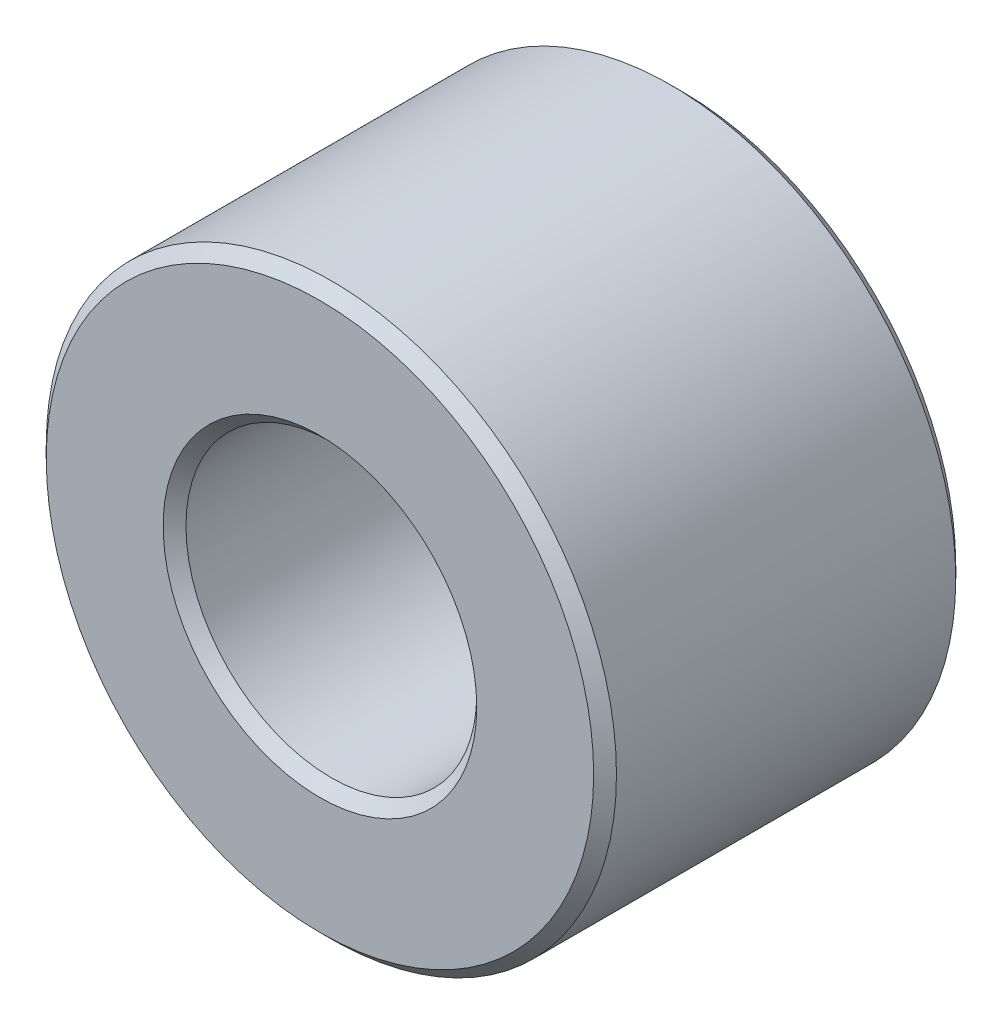
ISO-10303-21;
HEADER;
FILE_DESCRIPTION(('STEP AP214'),'2;1');
FILE_NAME('part.step','',(''),(''),'','','');
FILE_SCHEMA(('AUTOMOTIVE_DESIGN { 1 0 10303 214 1 1 1 1 }'));
ENDSEC;
DATA;
#1=APPLICATION_CONTEXT('core data for automotive mechanical design processes');
#2=APPLICATION_PROTOCOL_DEFINITION('international standard','automotive_design',2000,#1);
#3=PRODUCT_CONTEXT('',#1,'mechanical');
#4=PRODUCT('Part','Part','',(#3));
#5=PRODUCT_RELATED_PRODUCT_CATEGORY('part','',(#4));
#6=PRODUCT_DEFINITION_FORMATION('','',#4);
#7=PRODUCT_DEFINITION_CONTEXT('part definition',#1,'design');
#8=PRODUCT_DEFINITION('design','',#6,#7);
#9=PRODUCT_DEFINITION_SHAPE('','',#8);
#10=(LENGTH_UNIT() NAMED_UNIT(*) SI_UNIT(.MILLI.,.METRE.));
#11=(NAMED_UNIT(*) PLANE_ANGLE_UNIT() SI_UNIT($,.RADIAN.));
#12=(NAMED_UNIT(*) SI_UNIT($,.STERADIAN.) SOLID_ANGLE_UNIT());
#13=UNCERTAINTY_MEASURE_WITH_UNIT(LENGTH_MEASURE(1.E-05),#10,'distance_accuracy_value','');
#14=(GEOMETRIC_REPRESENTATION_CONTEXT(3) GLOBAL_UNCERTAINTY_ASSIGNED_CONTEXT((#13)) GLOBAL_UNIT_ASSIGNED_CONTEXT((#10,
#11,#12)) REPRESENTATION_CONTEXT('',''));
#15=CARTESIAN_POINT('',(0.,0.,0.));
#16=DIRECTION('',(0.,0.,1.));
#17=DIRECTION('',(1.,0.,0.));
#18=AXIS2_PLACEMENT_3D('',#15,#16,#17);
#19=CARTESIAN_POINT('',(0.,0.,6.35000000000002));
#20=DIRECTION('',(0.,0.,1.));
#21=DIRECTION('',(1.,0.,0.));
#22=AXIS2_PLACEMENT_3D('',#19,#20,#21);
#23=PLANE('',#22);
#24=CARTESIAN_POINT('',(0.,0.,6.35000000000002));
#25=DIRECTION('',(0.,0.,1.));
#26=DIRECTION('',(1.,0.,0.));
#27=AXIS2_PLACEMENT_3D('',#24,#25,#26);
#28=CIRCLE('',#27,2.75);
#29=CARTESIAN_POINT('',(2.75,0.,6.35000000000002));
#30=VERTEX_POINT('',#29);
#31=EDGE_CURVE('E12',#30,#30,#28,.F.);
#32=ORIENTED_EDGE('',*,*,#31,.T.);
#33=EDGE_LOOP('',(#32));
#34=FACE_BOUND('',#33,.T.);
#35=CARTESIAN_POINT('',(0.,0.,6.35000000000002));
#36=DIRECTION('',(0.,0.,1.));
#37=DIRECTION('',(1.,0.,0.));
#38=AXIS2_PLACEMENT_3D('',#35,#36,#37);
#39=CIRCLE('',#38,4.8);
#40=CARTESIAN_POINT('',(4.8,0.,6.35000000000002));
#41=VERTEX_POINT('',#40);
#42=EDGE_CURVE('E51',#41,#41,#39,.T.);
#43=ORIENTED_EDGE('',*,*,#42,.T.);
#44=EDGE_LOOP('',(#43));
#45=FACE_BOUND('',#44,.T.);
#46=ADVANCED_FACE('F44',(#34,#45),#23,.T.);
#47=CARTESIAN_POINT('',(0.,0.,0.));
#48=DIRECTION('',(0.,0.,1.));
#49=DIRECTION('',(1.,0.,0.));
#50=AXIS2_PLACEMENT_3D('',#47,#48,#49);
#51=PLANE('',#50);
#52=CARTESIAN_POINT('',(0.,0.,0.));
#53=DIRECTION('',(0.,0.,1.));
#54=DIRECTION('',(1.,0.,0.));
#55=AXIS2_PLACEMENT_3D('',#52,#53,#54);
#56=CIRCLE('',#55,4.8);
#57=CARTESIAN_POINT('',(4.8,0.,0.));
#58=VERTEX_POINT('',#57);
#59=EDGE_CURVE('E64',#58,#58,#56,.F.);
#60=ORIENTED_EDGE('',*,*,#59,.T.);
#61=EDGE_LOOP('',(#60));
#62=FACE_BOUND('',#61,.T.);
#63=CARTESIAN_POINT('',(0.,0.,0.));
#64=DIRECTION('',(0.,0.,1.));
#65=DIRECTION('',(1.,0.,0.));
#66=AXIS2_PLACEMENT_3D('',#63,#64,#65);
#67=CIRCLE('',#66,2.75);
#68=CARTESIAN_POINT('',(2.75,0.,0.));
#69=VERTEX_POINT('',#68);
#70=EDGE_CURVE('E67',#69,#69,#67,.T.);
#71=ORIENTED_EDGE('',*,*,#70,.T.);
#72=EDGE_LOOP('',(#71));
#73=FACE_BOUND('',#72,.T.);
#74=ADVANCED_FACE('F88',(#62,#73),#51,.F.);
#75=CARTESIAN_POINT('',(0.,0.,6.35000000000002));
#76=DIRECTION('',(0.,0.,-1.));
#77=DIRECTION('',(-1.,0.,0.));
#78=AXIS2_PLACEMENT_3D('',#75,#76,#77);
#79=CYLINDRICAL_SURFACE('',#78,5.);
#80=CARTESIAN_POINT('',(0.,0.,0.199999999999978));
#81=DIRECTION('',(0.,0.,1.));
#82=DIRECTION('',(1.,0.,0.));
#83=AXIS2_PLACEMENT_3D('',#80,#81,#82);
#84=CIRCLE('',#83,5.);
#85=CARTESIAN_POINT('',(5.,0.,0.199999999999979));
#86=VERTEX_POINT('',#85);
#87=EDGE_CURVE('E70',#86,#86,#84,.T.);
#88=ORIENTED_EDGE('',*,*,#87,.T.);
#89=EDGE_LOOP('',(#88));
#90=FACE_BOUND('',#89,.T.);
#91=CARTESIAN_POINT('',(0.,0.,6.14999999999999));
#92=DIRECTION('',(0.,0.,1.));
#93=DIRECTION('',(1.,0.,0.));
#94=AXIS2_PLACEMENT_3D('',#91,#92,#93);
#95=CIRCLE('',#94,5.);
#96=CARTESIAN_POINT('',(5.,0.,6.14999999999999));
#97=VERTEX_POINT('',#96);
#98=EDGE_CURVE('E73',#97,#97,#95,.F.);
#99=ORIENTED_EDGE('',*,*,#98,.T.);
#100=EDGE_LOOP('',(#99));
#101=FACE_BOUND('',#100,.T.);
#102=ADVANCED_FACE('F77',(#90,#101),#79,.T.);
#103=CARTESIAN_POINT('',(0.,0.,6.35000000000002));
#104=DIRECTION('',(0.,0.,-1.));
#105=DIRECTION('',(-1.,0.,0.));
#106=AXIS2_PLACEMENT_3D('',#103,#104,#105);
#107=CYLINDRICAL_SURFACE('',#106,2.55);
#108=CARTESIAN_POINT('',(0.,0.,0.199999999999978));
#109=DIRECTION('',(0.,0.,1.));
#110=DIRECTION('',(1.,0.,0.));
#111=AXIS2_PLACEMENT_3D('',#108,#109,#110);
#112=CIRCLE('',#111,2.55);
#113=CARTESIAN_POINT('',(2.55,0.,0.199999999999978));
#114=VERTEX_POINT('',#113);
#115=EDGE_CURVE('E55',#114,#114,#112,.F.);
#116=ORIENTED_EDGE('',*,*,#115,.T.);
#117=EDGE_LOOP('',(#116));
#118=FACE_BOUND('',#117,.T.);
#119=CARTESIAN_POINT('',(0.,0.,6.14999999999999));
#120=DIRECTION('',(0.,0.,1.));
#121=DIRECTION('',(1.,0.,0.));
#122=AXIS2_PLACEMENT_3D('',#119,#120,#121);
#123=CIRCLE('',#122,2.55);
#124=CARTESIAN_POINT('',(2.55,0.,6.14999999999999));
#125=VERTEX_POINT('',#124);
#126=EDGE_CURVE('E59',#125,#125,#123,.T.);
#127=ORIENTED_EDGE('',*,*,#126,.T.);
#128=EDGE_LOOP('',(#127));
#129=FACE_BOUND('',#128,.T.);
#130=ADVANCED_FACE('F96',(#118,#129),#107,.F.);
#131=CARTESIAN_POINT('',(0.,0.,0.199999999999978));
#132=DIRECTION('',(0.,0.,1.));
#133=DIRECTION('',(1.,0.,0.));
#134=AXIS2_PLACEMENT_3D('',#131,#132,#133);
#135=CONICAL_SURFACE('',#134,5.,0.785398163397448);
#136=ORIENTED_EDGE('',*,*,#59,.F.);
#137=EDGE_LOOP('',(#136));
#138=FACE_BOUND('',#137,.T.);
#139=ORIENTED_EDGE('',*,*,#87,.F.);
#140=EDGE_LOOP('',(#139));
#141=FACE_BOUND('',#140,.T.);
#142=ADVANCED_FACE('F101',(#138,#141),#135,.T.);
#143=CARTESIAN_POINT('',(0.,0.,0.));
#144=DIRECTION('',(0.,0.,-1.));
#145=DIRECTION('',(-1.,0.,0.));
#146=AXIS2_PLACEMENT_3D('',#143,#144,#145);
#147=CONICAL_SURFACE('',#146,2.75,0.785398163397447);
#148=ORIENTED_EDGE('',*,*,#115,.F.);
#149=EDGE_LOOP('',(#148));
#150=FACE_BOUND('',#149,.T.);
#151=ORIENTED_EDGE('',*,*,#70,.F.);
#152=EDGE_LOOP('',(#151));
#153=FACE_BOUND('',#152,.T.);
#154=ADVANCED_FACE('F85',(#150,#153),#147,.F.);
#155=CARTESIAN_POINT('',(0.,0.,6.14999999999999));
#156=DIRECTION('',(0.,0.,1.));
#157=DIRECTION('',(1.,0.,0.));
#158=AXIS2_PLACEMENT_3D('',#155,#156,#157);
#159=CONICAL_SURFACE('',#158,2.55,0.785398163397454);
#160=ORIENTED_EDGE('',*,*,#31,.F.);
#161=EDGE_LOOP('',(#160));
#162=FACE_BOUND('',#161,.T.);
#163=ORIENTED_EDGE('',*,*,#126,.F.);
#164=EDGE_LOOP('',(#163));
#165=FACE_BOUND('',#164,.T.);
#166=ADVANCED_FACE('F81',(#162,#165),#159,.F.);
#167=CARTESIAN_POINT('',(0.,0.,6.35000000000002));
#168=DIRECTION('',(0.,0.,-1.));
#169=DIRECTION('',(-1.,0.,0.));
#170=AXIS2_PLACEMENT_3D('',#167,#168,#169);
#171=CONICAL_SURFACE('',#170,4.8,0.785398163397444);
#172=ORIENTED_EDGE('',*,*,#98,.F.);
#173=EDGE_LOOP('',(#172));
#174=FACE_BOUND('',#173,.T.);
#175=ORIENTED_EDGE('',*,*,#42,.F.);
#176=EDGE_LOOP('',(#175));
#177=FACE_BOUND('',#176,.T.);
#178=ADVANCED_FACE('F46',(#174,#177),#171,.T.);
#179=CLOSED_SHELL('',(#46,#74,#102,#130,#142,#154,#166,#178));
#180=MANIFOLD_SOLID_BREP('B2',#179);
#181=ADVANCED_BREP_SHAPE_REPRESENTATION('',(#18,#180),#14);
#182=SHAPE_DEFINITION_REPRESENTATION(#9,#181);
ENDSEC;
END-ISO-10303-21;
